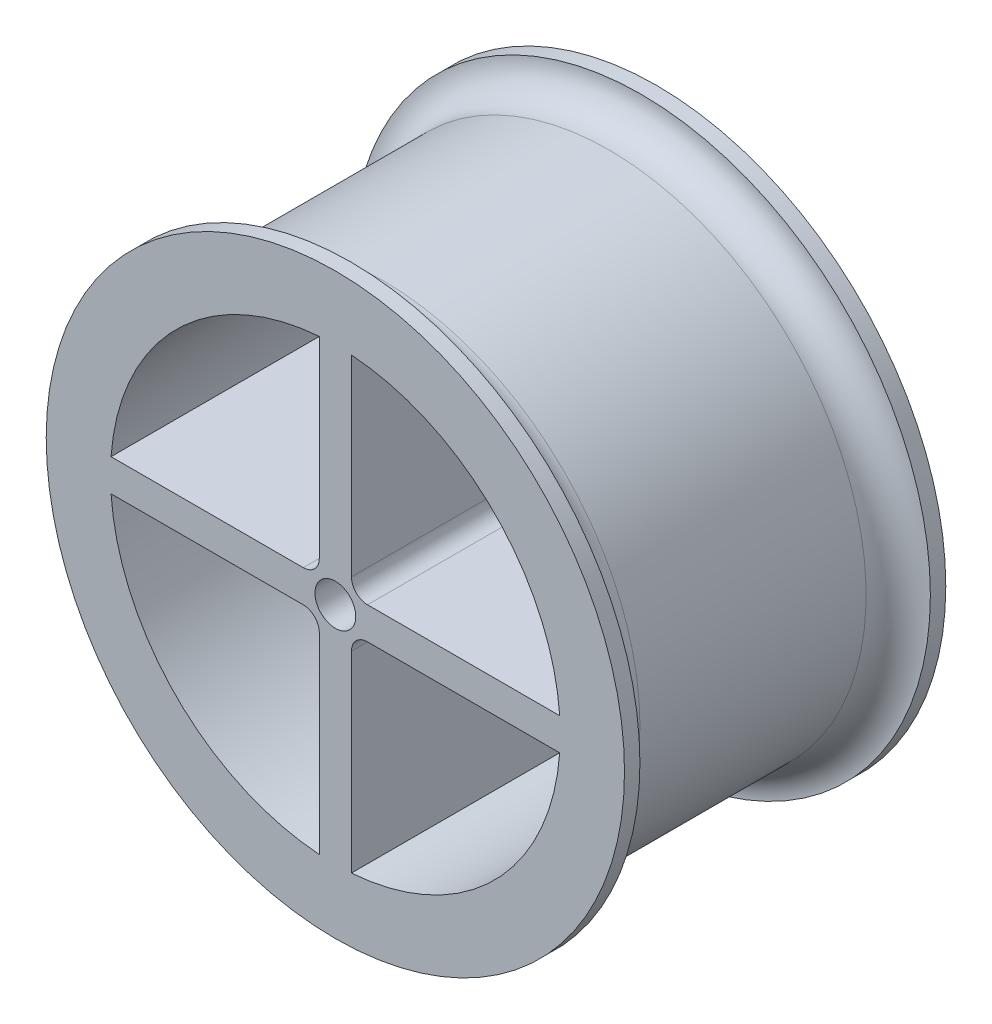
ISO-10303-21;
HEADER;
FILE_DESCRIPTION(('STEP AP214'),'2;1');
FILE_NAME('part.step','',(''),(''),'','','');
FILE_SCHEMA(('AUTOMOTIVE_DESIGN { 1 0 10303 214 1 1 1 1 }'));
ENDSEC;
DATA;
#1=APPLICATION_CONTEXT('core data for automotive mechanical design processes');
#2=APPLICATION_PROTOCOL_DEFINITION('international standard','automotive_design',2000,#1);
#3=PRODUCT_CONTEXT('',#1,'mechanical');
#4=PRODUCT('Part','Part','',(#3));
#5=PRODUCT_RELATED_PRODUCT_CATEGORY('part','',(#4));
#6=PRODUCT_DEFINITION_FORMATION('','',#4);
#7=PRODUCT_DEFINITION_CONTEXT('part definition',#1,'design');
#8=PRODUCT_DEFINITION('design','',#6,#7);
#9=PRODUCT_DEFINITION_SHAPE('','',#8);
#10=(LENGTH_UNIT() NAMED_UNIT(*) SI_UNIT(.MILLI.,.METRE.));
#11=(NAMED_UNIT(*) PLANE_ANGLE_UNIT() SI_UNIT($,.RADIAN.));
#12=(NAMED_UNIT(*) SI_UNIT($,.STERADIAN.) SOLID_ANGLE_UNIT());
#13=UNCERTAINTY_MEASURE_WITH_UNIT(LENGTH_MEASURE(1.E-05),#10,'distance_accuracy_value','');
#14=(GEOMETRIC_REPRESENTATION_CONTEXT(3) GLOBAL_UNCERTAINTY_ASSIGNED_CONTEXT((#13)) GLOBAL_UNIT_ASSIGNED_CONTEXT((#10,
#11,#12)) REPRESENTATION_CONTEXT('',''));
#15=CARTESIAN_POINT('',(0.,0.,0.));
#16=DIRECTION('',(0.,0.,1.));
#17=DIRECTION('',(1.,0.,0.));
#18=AXIS2_PLACEMENT_3D('',#15,#16,#17);
#19=CARTESIAN_POINT('',(0.,0.,25.));
#20=DIRECTION('',(0.,0.,-1.));
#21=DIRECTION('',(-1.,0.,0.));
#22=AXIS2_PLACEMENT_3D('',#19,#20,#21);
#23=CYLINDRICAL_SURFACE('',#22,40.);
#24=CARTESIAN_POINT('',(0.,0.,-17.6));
#25=DIRECTION('',(0.,0.,-1.));
#26=DIRECTION('',(-1.,0.,0.));
#27=AXIS2_PLACEMENT_3D('',#24,#25,#26);
#28=CIRCLE('',#27,40.);
#29=CARTESIAN_POINT('',(-40.,0.,-17.6));
#30=VERTEX_POINT('',#29);
#31=EDGE_CURVE('E11',#30,#30,#28,.F.);
#32=ORIENTED_EDGE('',*,*,#31,.T.);
#33=EDGE_LOOP('',(#32));
#34=FACE_BOUND('',#33,.T.);
#35=CARTESIAN_POINT('',(0.,0.,17.6));
#36=DIRECTION('',(0.,0.,1.));
#37=DIRECTION('',(1.,0.,0.));
#38=AXIS2_PLACEMENT_3D('',#35,#36,#37);
#39=CIRCLE('',#38,40.);
#40=CARTESIAN_POINT('',(40.,0.,17.6));
#41=VERTEX_POINT('',#40);
#42=EDGE_CURVE('E42',#41,#41,#39,.F.);
#43=ORIENTED_EDGE('',*,*,#42,.T.);
#44=EDGE_LOOP('',(#43));
#45=FACE_BOUND('',#44,.T.);
#46=ADVANCED_FACE('F34',(#34,#45),#23,.T.);
#47=CARTESIAN_POINT('',(0.,-2.5,25.));
#48=DIRECTION('',(0.,1.,0.));
#49=DIRECTION('',(0.,0.,1.));
#50=AXIS2_PLACEMENT_3D('',#47,#48,#49);
#51=PLANE('',#50);
#52=DIRECTION('',(1.,0.,0.));
#53=VECTOR('',#52,1.);
#54=CARTESIAN_POINT('',(0.,-2.5,-25.));
#55=LINE('',#54,#53);
#56=CARTESIAN_POINT('',(-34.9106001094224,-2.5,-25.));
#57=VERTEX_POINT('',#56);
#58=CARTESIAN_POINT('',(-5.,-2.5,-25.));
#59=VERTEX_POINT('',#58);
#60=EDGE_CURVE('E229',#57,#59,#55,.T.);
#61=ORIENTED_EDGE('',*,*,#60,.T.);
#62=DIRECTION('',(0.,0.,-1.));
#63=VECTOR('',#62,1.);
#64=CARTESIAN_POINT('',(-5.,-2.5,25.));
#65=LINE('',#64,#63);
#66=CARTESIAN_POINT('',(-5.,-2.5,25.));
#67=VERTEX_POINT('',#66);
#68=EDGE_CURVE('E255',#59,#67,#65,.F.);
#69=ORIENTED_EDGE('',*,*,#68,.T.);
#70=DIRECTION('',(1.,0.,0.));
#71=VECTOR('',#70,1.);
#72=CARTESIAN_POINT('',(0.,-2.5,25.));
#73=LINE('',#72,#71);
#74=CARTESIAN_POINT('',(-34.9106001094224,-2.5,25.));
#75=VERTEX_POINT('',#74);
#76=EDGE_CURVE('E198',#75,#67,#73,.T.);
#77=ORIENTED_EDGE('',*,*,#76,.F.);
#78=DIRECTION('',(0.,0.,-1.));
#79=VECTOR('',#78,1.);
#80=CARTESIAN_POINT('',(-34.9106001094224,-2.5,25.));
#81=LINE('',#80,#79);
#82=EDGE_CURVE('E237',#75,#57,#81,.T.);
#83=ORIENTED_EDGE('',*,*,#82,.T.);
#84=EDGE_LOOP('',(#61,#69,#77,#83));
#85=FACE_BOUND('',#84,.T.);
#86=ADVANCED_FACE('F339',(#85),#51,.F.);
#87=CARTESIAN_POINT('',(-2.5,0.,25.));
#88=DIRECTION('',(1.,0.,0.));
#89=DIRECTION('',(0.,0.,-1.));
#90=AXIS2_PLACEMENT_3D('',#87,#88,#89);
#91=PLANE('',#90);
#92=DIRECTION('',(0.,-1.,0.));
#93=VECTOR('',#92,1.);
#94=CARTESIAN_POINT('',(-2.5,0.,25.));
#95=LINE('',#94,#93);
#96=CARTESIAN_POINT('',(-2.5,-5.,25.));
#97=VERTEX_POINT('',#96);
#98=CARTESIAN_POINT('',(-2.5,-34.9106001094224,25.));
#99=VERTEX_POINT('',#98);
#100=EDGE_CURVE('E201',#97,#99,#95,.T.);
#101=ORIENTED_EDGE('',*,*,#100,.F.);
#102=DIRECTION('',(0.,0.,-1.));
#103=VECTOR('',#102,1.);
#104=CARTESIAN_POINT('',(-2.5,-5.,-25.));
#105=LINE('',#104,#103);
#106=CARTESIAN_POINT('',(-2.5,-5.,-25.));
#107=VERTEX_POINT('',#106);
#108=EDGE_CURVE('E243',#97,#107,#105,.T.);
#109=ORIENTED_EDGE('',*,*,#108,.T.);
#110=DIRECTION('',(0.,-1.,0.));
#111=VECTOR('',#110,1.);
#112=CARTESIAN_POINT('',(-2.5,0.,-25.));
#113=LINE('',#112,#111);
#114=CARTESIAN_POINT('',(-2.5,-34.9106001094224,-25.));
#115=VERTEX_POINT('',#114);
#116=EDGE_CURVE('E232',#107,#115,#113,.T.);
#117=ORIENTED_EDGE('',*,*,#116,.T.);
#118=DIRECTION('',(0.,0.,-1.));
#119=VECTOR('',#118,1.);
#120=CARTESIAN_POINT('',(-2.5,-34.9106001094224,25.));
#121=LINE('',#120,#119);
#122=EDGE_CURVE('E239',#99,#115,#121,.T.);
#123=ORIENTED_EDGE('',*,*,#122,.F.);
#124=EDGE_LOOP('',(#101,#109,#117,#123));
#125=FACE_BOUND('',#124,.T.);
#126=ADVANCED_FACE('F345',(#125),#91,.F.);
#127=CARTESIAN_POINT('',(2.5,0.,25.));
#128=DIRECTION('',(1.,0.,0.));
#129=DIRECTION('',(0.,0.,-1.));
#130=AXIS2_PLACEMENT_3D('',#127,#128,#129);
#131=PLANE('',#130);
#132=DIRECTION('',(0.,-1.,0.));
#133=VECTOR('',#132,1.);
#134=CARTESIAN_POINT('',(2.5,0.,-25.));
#135=LINE('',#134,#133);
#136=CARTESIAN_POINT('',(2.5,-5.,-25.));
#137=VERTEX_POINT('',#136);
#138=CARTESIAN_POINT('',(2.5,-34.9106001094224,-25.));
#139=VERTEX_POINT('',#138);
#140=EDGE_CURVE('E222',#137,#139,#135,.T.);
#141=ORIENTED_EDGE('',*,*,#140,.F.);
#142=DIRECTION('',(0.,0.,-1.));
#143=VECTOR('',#142,1.);
#144=CARTESIAN_POINT('',(2.5,-5.,25.));
#145=LINE('',#144,#143);
#146=CARTESIAN_POINT('',(2.5,-5.,25.));
#147=VERTEX_POINT('',#146);
#148=EDGE_CURVE('E260',#137,#147,#145,.F.);
#149=ORIENTED_EDGE('',*,*,#148,.T.);
#150=DIRECTION('',(0.,-1.,0.));
#151=VECTOR('',#150,1.);
#152=CARTESIAN_POINT('',(2.5,0.,25.));
#153=LINE('',#152,#151);
#154=CARTESIAN_POINT('',(2.5,-34.9106001094224,25.));
#155=VERTEX_POINT('',#154);
#156=EDGE_CURVE('E191',#147,#155,#153,.T.);
#157=ORIENTED_EDGE('',*,*,#156,.T.);
#158=DIRECTION('',(0.,0.,-1.));
#159=VECTOR('',#158,1.);
#160=CARTESIAN_POINT('',(2.5,-34.9106001094224,25.));
#161=LINE('',#160,#159);
#162=EDGE_CURVE('E244',#155,#139,#161,.T.);
#163=ORIENTED_EDGE('',*,*,#162,.T.);
#164=EDGE_LOOP('',(#141,#149,#157,#163));
#165=FACE_BOUND('',#164,.T.);
#166=ADVANCED_FACE('F356',(#165),#131,.T.);
#167=CARTESIAN_POINT('',(0.,-2.5,25.));
#168=DIRECTION('',(0.,1.,0.));
#169=DIRECTION('',(0.,0.,1.));
#170=AXIS2_PLACEMENT_3D('',#167,#168,#169);
#171=PLANE('',#170);
#172=DIRECTION('',(1.,0.,0.));
#173=VECTOR('',#172,1.);
#174=CARTESIAN_POINT('',(0.,-2.5,25.));
#175=LINE('',#174,#173);
#176=CARTESIAN_POINT('',(5.,-2.5,25.));
#177=VERTEX_POINT('',#176);
#178=CARTESIAN_POINT('',(34.9106001094224,-2.5,25.));
#179=VERTEX_POINT('',#178);
#180=EDGE_CURVE('E193',#177,#179,#175,.T.);
#181=ORIENTED_EDGE('',*,*,#180,.F.);
#182=DIRECTION('',(0.,0.,-1.));
#183=VECTOR('',#182,1.);
#184=CARTESIAN_POINT('',(5.,-2.5,25.));
#185=LINE('',#184,#183);
#186=CARTESIAN_POINT('',(5.,-2.5,-25.));
#187=VERTEX_POINT('',#186);
#188=EDGE_CURVE('E257',#177,#187,#185,.T.);
#189=ORIENTED_EDGE('',*,*,#188,.T.);
#190=DIRECTION('',(1.,0.,0.));
#191=VECTOR('',#190,1.);
#192=CARTESIAN_POINT('',(0.,-2.5,-25.));
#193=LINE('',#192,#191);
#194=CARTESIAN_POINT('',(34.9106001094224,-2.5,-25.));
#195=VERTEX_POINT('',#194);
#196=EDGE_CURVE('E224',#187,#195,#193,.T.);
#197=ORIENTED_EDGE('',*,*,#196,.T.);
#198=DIRECTION('',(0.,0.,-1.));
#199=VECTOR('',#198,1.);
#200=CARTESIAN_POINT('',(34.9106001094224,-2.5,25.));
#201=LINE('',#200,#199);
#202=EDGE_CURVE('E240',#179,#195,#201,.T.);
#203=ORIENTED_EDGE('',*,*,#202,.F.);
#204=EDGE_LOOP('',(#181,#189,#197,#203));
#205=FACE_BOUND('',#204,.T.);
#206=ADVANCED_FACE('F363',(#205),#171,.F.);
#207=CARTESIAN_POINT('',(0.,0.,25.));
#208=DIRECTION('',(0.,0.,-1.));
#209=DIRECTION('',(-1.,0.,0.));
#210=AXIS2_PLACEMENT_3D('',#207,#208,#209);
#211=CYLINDRICAL_SURFACE('',#210,35.);
#212=CARTESIAN_POINT('',(0.,0.,-25.));
#213=DIRECTION('',(0.,0.,1.));
#214=DIRECTION('',(1.,0.,0.));
#215=AXIS2_PLACEMENT_3D('',#212,#213,#214);
#216=CIRCLE('',#215,35.);
#217=CARTESIAN_POINT('',(-2.5,34.9106001094224,-25.));
#218=VERTEX_POINT('',#217);
#219=CARTESIAN_POINT('',(-34.9106001094224,2.5,-25.));
#220=VERTEX_POINT('',#219);
#221=EDGE_CURVE('E215',#218,#220,#216,.T.);
#222=ORIENTED_EDGE('',*,*,#221,.F.);
#223=DIRECTION('',(0.,0.,-1.));
#224=VECTOR('',#223,1.);
#225=CARTESIAN_POINT('',(-2.5,34.9106001094224,25.));
#226=LINE('',#225,#224);
#227=CARTESIAN_POINT('',(-2.5,34.9106001094224,25.));
#228=VERTEX_POINT('',#227);
#229=EDGE_CURVE('E247',#228,#218,#226,.T.);
#230=ORIENTED_EDGE('',*,*,#229,.F.);
#231=CARTESIAN_POINT('',(0.,0.,25.));
#232=DIRECTION('',(0.,0.,1.));
#233=DIRECTION('',(1.,0.,0.));
#234=AXIS2_PLACEMENT_3D('',#231,#232,#233);
#235=CIRCLE('',#234,35.);
#236=CARTESIAN_POINT('',(-34.9106001094224,2.5,25.));
#237=VERTEX_POINT('',#236);
#238=EDGE_CURVE('E180',#228,#237,#235,.T.);
#239=ORIENTED_EDGE('',*,*,#238,.T.);
#240=DIRECTION('',(0.,0.,-1.));
#241=VECTOR('',#240,1.);
#242=CARTESIAN_POINT('',(-34.9106001094224,2.5,25.));
#243=LINE('',#242,#241);
#244=EDGE_CURVE('E161',#237,#220,#243,.T.);
#245=ORIENTED_EDGE('',*,*,#244,.T.);
#246=EDGE_LOOP('',(#222,#230,#239,#245));
#247=FACE_BOUND('',#246,.T.);
#248=ADVANCED_FACE('F366',(#247),#211,.F.);
#249=CARTESIAN_POINT('',(-2.5,0.,25.));
#250=DIRECTION('',(1.,0.,0.));
#251=DIRECTION('',(0.,0.,-1.));
#252=AXIS2_PLACEMENT_3D('',#249,#250,#251);
#253=PLANE('',#252);
#254=DIRECTION('',(0.,-1.,0.));
#255=VECTOR('',#254,1.);
#256=CARTESIAN_POINT('',(-2.5,0.,-25.));
#257=LINE('',#256,#255);
#258=CARTESIAN_POINT('',(-2.5,5.,-25.));
#259=VERTEX_POINT('',#258);
#260=EDGE_CURVE('E218',#218,#259,#257,.T.);
#261=ORIENTED_EDGE('',*,*,#260,.T.);
#262=DIRECTION('',(0.,0.,-1.));
#263=VECTOR('',#262,1.);
#264=CARTESIAN_POINT('',(-2.5,5.,25.));
#265=LINE('',#264,#263);
#266=CARTESIAN_POINT('',(-2.5,5.,25.));
#267=VERTEX_POINT('',#266);
#268=EDGE_CURVE('E49',#259,#267,#265,.F.);
#269=ORIENTED_EDGE('',*,*,#268,.T.);
#270=DIRECTION('',(0.,-1.,0.));
#271=VECTOR('',#270,1.);
#272=CARTESIAN_POINT('',(-2.5,0.,25.));
#273=LINE('',#272,#271);
#274=EDGE_CURVE('E186',#228,#267,#273,.T.);
#275=ORIENTED_EDGE('',*,*,#274,.F.);
#276=ORIENTED_EDGE('',*,*,#229,.T.);
#277=EDGE_LOOP('',(#261,#269,#275,#276));
#278=FACE_BOUND('',#277,.T.);
#279=ADVANCED_FACE('F375',(#278),#253,.F.);
#280=CARTESIAN_POINT('',(0.,2.5,25.));
#281=DIRECTION('',(0.,1.,0.));
#282=DIRECTION('',(0.,0.,1.));
#283=AXIS2_PLACEMENT_3D('',#280,#281,#282);
#284=PLANE('',#283);
#285=DIRECTION('',(1.,0.,0.));
#286=VECTOR('',#285,1.);
#287=CARTESIAN_POINT('',(0.,2.5,-25.));
#288=LINE('',#287,#286);
#289=CARTESIAN_POINT('',(5.,2.5,-25.));
#290=VERTEX_POINT('',#289);
#291=CARTESIAN_POINT('',(34.9106001094224,2.5,-25.));
#292=VERTEX_POINT('',#291);
#293=EDGE_CURVE('E206',#290,#292,#288,.T.);
#294=ORIENTED_EDGE('',*,*,#293,.F.);
#295=DIRECTION('',(0.,0.,-1.));
#296=VECTOR('',#295,1.);
#297=CARTESIAN_POINT('',(5.,2.5,25.));
#298=LINE('',#297,#296);
#299=CARTESIAN_POINT('',(5.,2.5,25.));
#300=VERTEX_POINT('',#299);
#301=EDGE_CURVE('E264',#290,#300,#298,.F.);
#302=ORIENTED_EDGE('',*,*,#301,.T.);
#303=DIRECTION('',(1.,0.,0.));
#304=VECTOR('',#303,1.);
#305=CARTESIAN_POINT('',(0.,2.5,25.));
#306=LINE('',#305,#304);
#307=CARTESIAN_POINT('',(34.9106001094224,2.5,25.));
#308=VERTEX_POINT('',#307);
#309=EDGE_CURVE('E172',#300,#308,#306,.T.);
#310=ORIENTED_EDGE('',*,*,#309,.T.);
#311=DIRECTION('',(0.,0.,-1.));
#312=VECTOR('',#311,1.);
#313=CARTESIAN_POINT('',(34.9106001094224,2.5,25.));
#314=LINE('',#313,#312);
#315=EDGE_CURVE('E162',#308,#292,#314,.T.);
#316=ORIENTED_EDGE('',*,*,#315,.T.);
#317=EDGE_LOOP('',(#294,#302,#310,#316));
#318=FACE_BOUND('',#317,.T.);
#319=ADVANCED_FACE('F305',(#318),#284,.T.);
#320=CARTESIAN_POINT('',(2.5,0.,25.));
#321=DIRECTION('',(1.,0.,0.));
#322=DIRECTION('',(0.,0.,-1.));
#323=AXIS2_PLACEMENT_3D('',#320,#321,#322);
#324=PLANE('',#323);
#325=DIRECTION('',(0.,-1.,0.));
#326=VECTOR('',#325,1.);
#327=CARTESIAN_POINT('',(2.5,0.,25.));
#328=LINE('',#327,#326);
#329=CARTESIAN_POINT('',(2.5,34.9106001094224,25.));
#330=VERTEX_POINT('',#329);
#331=CARTESIAN_POINT('',(2.5,5.,25.));
#332=VERTEX_POINT('',#331);
#333=EDGE_CURVE('E153',#330,#332,#328,.T.);
#334=ORIENTED_EDGE('',*,*,#333,.T.);
#335=DIRECTION('',(0.,0.,-1.));
#336=VECTOR('',#335,1.);
#337=CARTESIAN_POINT('',(2.5,5.,-25.));
#338=LINE('',#337,#336);
#339=CARTESIAN_POINT('',(2.5,5.,-25.));
#340=VERTEX_POINT('',#339);
#341=EDGE_CURVE('E262',#332,#340,#338,.T.);
#342=ORIENTED_EDGE('',*,*,#341,.T.);
#343=DIRECTION('',(0.,-1.,0.));
#344=VECTOR('',#343,1.);
#345=CARTESIAN_POINT('',(2.5,0.,-25.));
#346=LINE('',#345,#344);
#347=CARTESIAN_POINT('',(2.5,34.9106001094224,-25.));
#348=VERTEX_POINT('',#347);
#349=EDGE_CURVE('E156',#348,#340,#346,.T.);
#350=ORIENTED_EDGE('',*,*,#349,.F.);
#351=DIRECTION('',(0.,0.,-1.));
#352=VECTOR('',#351,1.);
#353=CARTESIAN_POINT('',(2.5,34.9106001094224,25.));
#354=LINE('',#353,#352);
#355=EDGE_CURVE('E149',#330,#348,#354,.T.);
#356=ORIENTED_EDGE('',*,*,#355,.F.);
#357=EDGE_LOOP('',(#334,#342,#350,#356));
#358=FACE_BOUND('',#357,.T.);
#359=ADVANCED_FACE('F151',(#358),#324,.T.);
#360=CARTESIAN_POINT('',(0.,0.,25.));
#361=DIRECTION('',(0.,0.,-1.));
#362=DIRECTION('',(-1.,0.,0.));
#363=AXIS2_PLACEMENT_3D('',#360,#361,#362);
#364=CYLINDRICAL_SURFACE('',#363,35.);
#365=CARTESIAN_POINT('',(0.,0.,-25.));
#366=DIRECTION('',(0.,0.,1.));
#367=DIRECTION('',(1.,0.,0.));
#368=AXIS2_PLACEMENT_3D('',#365,#366,#367);
#369=CIRCLE('',#368,35.);
#370=EDGE_CURVE('E234',#57,#115,#369,.T.);
#371=ORIENTED_EDGE('',*,*,#370,.F.);
#372=ORIENTED_EDGE('',*,*,#82,.F.);
#373=CARTESIAN_POINT('',(0.,0.,25.));
#374=DIRECTION('',(0.,0.,1.));
#375=DIRECTION('',(1.,0.,0.));
#376=AXIS2_PLACEMENT_3D('',#373,#374,#375);
#377=CIRCLE('',#376,35.);
#378=EDGE_CURVE('E203',#75,#99,#377,.T.);
#379=ORIENTED_EDGE('',*,*,#378,.T.);
#380=ORIENTED_EDGE('',*,*,#122,.T.);
#381=EDGE_LOOP('',(#371,#372,#379,#380));
#382=FACE_BOUND('',#381,.T.);
#383=ADVANCED_FACE('F350',(#382),#364,.F.);
#384=CARTESIAN_POINT('',(0.,0.,25.));
#385=DIRECTION('',(0.,0.,-1.));
#386=DIRECTION('',(-1.,0.,0.));
#387=AXIS2_PLACEMENT_3D('',#384,#385,#386);
#388=CYLINDRICAL_SURFACE('',#387,35.);
#389=CARTESIAN_POINT('',(0.,0.,-25.));
#390=DIRECTION('',(0.,0.,1.));
#391=DIRECTION('',(1.,0.,0.));
#392=AXIS2_PLACEMENT_3D('',#389,#390,#391);
#393=CIRCLE('',#392,35.);
#394=EDGE_CURVE('E226',#139,#195,#393,.T.);
#395=ORIENTED_EDGE('',*,*,#394,.F.);
#396=ORIENTED_EDGE('',*,*,#162,.F.);
#397=CARTESIAN_POINT('',(0.,0.,25.));
#398=DIRECTION('',(0.,0.,1.));
#399=DIRECTION('',(1.,0.,0.));
#400=AXIS2_PLACEMENT_3D('',#397,#398,#399);
#401=CIRCLE('',#400,35.);
#402=EDGE_CURVE('E195',#155,#179,#401,.T.);
#403=ORIENTED_EDGE('',*,*,#402,.T.);
#404=ORIENTED_EDGE('',*,*,#202,.T.);
#405=EDGE_LOOP('',(#395,#396,#403,#404));
#406=FACE_BOUND('',#405,.T.);
#407=ADVANCED_FACE('F353',(#406),#388,.F.);
#408=CARTESIAN_POINT('',(0.,2.5,25.));
#409=DIRECTION('',(0.,1.,0.));
#410=DIRECTION('',(0.,0.,1.));
#411=AXIS2_PLACEMENT_3D('',#408,#409,#410);
#412=PLANE('',#411);
#413=DIRECTION('',(1.,0.,0.));
#414=VECTOR('',#413,1.);
#415=CARTESIAN_POINT('',(0.,2.5,25.));
#416=LINE('',#415,#414);
#417=CARTESIAN_POINT('',(-5.,2.5,25.));
#418=VERTEX_POINT('',#417);
#419=EDGE_CURVE('E188',#237,#418,#416,.T.);
#420=ORIENTED_EDGE('',*,*,#419,.T.);
#421=DIRECTION('',(0.,0.,-1.));
#422=VECTOR('',#421,1.);
#423=CARTESIAN_POINT('',(-5.,2.5,25.));
#424=LINE('',#423,#422);
#425=CARTESIAN_POINT('',(-5.,2.5,-25.));
#426=VERTEX_POINT('',#425);
#427=EDGE_CURVE('E266',#418,#426,#424,.T.);
#428=ORIENTED_EDGE('',*,*,#427,.T.);
#429=DIRECTION('',(1.,0.,0.));
#430=VECTOR('',#429,1.);
#431=CARTESIAN_POINT('',(0.,2.5,-25.));
#432=LINE('',#431,#430);
#433=EDGE_CURVE('E220',#220,#426,#432,.T.);
#434=ORIENTED_EDGE('',*,*,#433,.F.);
#435=ORIENTED_EDGE('',*,*,#244,.F.);
#436=EDGE_LOOP('',(#420,#428,#434,#435));
#437=FACE_BOUND('',#436,.T.);
#438=ADVANCED_FACE('F361',(#437),#412,.T.);
#439=CARTESIAN_POINT('',(0.,0.,25.));
#440=DIRECTION('',(0.,0.,-1.));
#441=DIRECTION('',(-1.,0.,0.));
#442=AXIS2_PLACEMENT_3D('',#439,#440,#441);
#443=CYLINDRICAL_SURFACE('',#442,3.175);
#444=CARTESIAN_POINT('',(0.,0.,25.));
#445=DIRECTION('',(0.,0.,1.));
#446=DIRECTION('',(1.,0.,0.));
#447=AXIS2_PLACEMENT_3D('',#444,#445,#446);
#448=CIRCLE('',#447,3.175);
#449=CARTESIAN_POINT('',(3.175,0.,25.));
#450=VERTEX_POINT('',#449);
#451=EDGE_CURVE('E177',#450,#450,#448,.T.);
#452=ORIENTED_EDGE('',*,*,#451,.T.);
#453=EDGE_LOOP('',(#452));
#454=FACE_BOUND('',#453,.T.);
#455=CARTESIAN_POINT('',(0.,0.,-25.));
#456=DIRECTION('',(0.,0.,1.));
#457=DIRECTION('',(1.,0.,0.));
#458=AXIS2_PLACEMENT_3D('',#455,#456,#457);
#459=CIRCLE('',#458,3.175);
#460=CARTESIAN_POINT('',(3.175,0.,-25.));
#461=VERTEX_POINT('',#460);
#462=EDGE_CURVE('E212',#461,#461,#459,.T.);
#463=ORIENTED_EDGE('',*,*,#462,.F.);
#464=EDGE_LOOP('',(#463));
#465=FACE_BOUND('',#464,.T.);
#466=ADVANCED_FACE('F373',(#454,#465),#443,.F.);
#467=CARTESIAN_POINT('',(0.,0.,25.));
#468=DIRECTION('',(0.,0.,-1.));
#469=DIRECTION('',(-1.,0.,0.));
#470=AXIS2_PLACEMENT_3D('',#467,#468,#469);
#471=CYLINDRICAL_SURFACE('',#470,35.);
#472=CARTESIAN_POINT('',(0.,0.,-25.));
#473=DIRECTION('',(0.,0.,1.));
#474=DIRECTION('',(1.,0.,0.));
#475=AXIS2_PLACEMENT_3D('',#472,#473,#474);
#476=CIRCLE('',#475,35.);
#477=EDGE_CURVE('E210',#292,#348,#476,.T.);
#478=ORIENTED_EDGE('',*,*,#477,.F.);
#479=ORIENTED_EDGE('',*,*,#315,.F.);
#480=CARTESIAN_POINT('',(0.,0.,25.));
#481=DIRECTION('',(0.,0.,1.));
#482=DIRECTION('',(1.,0.,0.));
#483=AXIS2_PLACEMENT_3D('',#480,#481,#482);
#484=CIRCLE('',#483,35.);
#485=EDGE_CURVE('E169',#308,#330,#484,.T.);
#486=ORIENTED_EDGE('',*,*,#485,.T.);
#487=ORIENTED_EDGE('',*,*,#355,.T.);
#488=EDGE_LOOP('',(#478,#479,#486,#487));
#489=FACE_BOUND('',#488,.T.);
#490=ADVANCED_FACE('F175',(#489),#471,.F.);
#491=CARTESIAN_POINT('',(0.,0.,25.));
#492=DIRECTION('',(0.,0.,1.));
#493=DIRECTION('',(1.,0.,0.));
#494=AXIS2_PLACEMENT_3D('',#491,#492,#493);
#495=PLANE('',#494);
#496=ORIENTED_EDGE('',*,*,#309,.F.);
#497=CARTESIAN_POINT('',(5.,5.,25.));
#498=DIRECTION('',(0.,0.,1.));
#499=DIRECTION('',(1.,0.,0.));
#500=AXIS2_PLACEMENT_3D('',#497,#498,#499);
#501=CIRCLE('',#500,2.5);
#502=EDGE_CURVE('E171',#300,#332,#501,.F.);
#503=ORIENTED_EDGE('',*,*,#502,.T.);
#504=ORIENTED_EDGE('',*,*,#333,.F.);
#505=ORIENTED_EDGE('',*,*,#485,.F.);
#506=EDGE_LOOP('',(#496,#503,#504,#505));
#507=FACE_BOUND('',#506,.T.);
#508=ORIENTED_EDGE('',*,*,#451,.F.);
#509=EDGE_LOOP('',(#508));
#510=FACE_BOUND('',#509,.T.);
#511=ORIENTED_EDGE('',*,*,#238,.F.);
#512=ORIENTED_EDGE('',*,*,#274,.T.);
#513=CARTESIAN_POINT('',(-5.,5.,25.));
#514=DIRECTION('',(0.,0.,1.));
#515=DIRECTION('',(1.,0.,0.));
#516=AXIS2_PLACEMENT_3D('',#513,#514,#515);
#517=CIRCLE('',#516,2.5);
#518=EDGE_CURVE('E282',#267,#418,#517,.F.);
#519=ORIENTED_EDGE('',*,*,#518,.T.);
#520=ORIENTED_EDGE('',*,*,#419,.F.);
#521=EDGE_LOOP('',(#511,#512,#519,#520));
#522=FACE_BOUND('',#521,.T.);
#523=ORIENTED_EDGE('',*,*,#156,.F.);
#524=CARTESIAN_POINT('',(5.,-5.,25.));
#525=DIRECTION('',(0.,0.,1.));
#526=DIRECTION('',(1.,0.,0.));
#527=AXIS2_PLACEMENT_3D('',#524,#525,#526);
#528=CIRCLE('',#527,2.5);
#529=EDGE_CURVE('E276',#147,#177,#528,.F.);
#530=ORIENTED_EDGE('',*,*,#529,.T.);
#531=ORIENTED_EDGE('',*,*,#180,.T.);
#532=ORIENTED_EDGE('',*,*,#402,.F.);
#533=EDGE_LOOP('',(#523,#530,#531,#532));
#534=FACE_BOUND('',#533,.T.);
#535=ORIENTED_EDGE('',*,*,#76,.T.);
#536=CARTESIAN_POINT('',(-5.,-5.,25.));
#537=DIRECTION('',(0.,0.,1.));
#538=DIRECTION('',(1.,0.,0.));
#539=AXIS2_PLACEMENT_3D('',#536,#537,#538);
#540=CIRCLE('',#539,2.5);
#541=EDGE_CURVE('E272',#67,#97,#540,.F.);
#542=ORIENTED_EDGE('',*,*,#541,.T.);
#543=ORIENTED_EDGE('',*,*,#100,.T.);
#544=ORIENTED_EDGE('',*,*,#378,.F.);
#545=EDGE_LOOP('',(#535,#542,#543,#544));
#546=FACE_BOUND('',#545,.T.);
#547=CARTESIAN_POINT('',(0.,0.,25.));
#548=DIRECTION('',(0.,0.,1.));
#549=DIRECTION('',(1.,0.,0.));
#550=AXIS2_PLACEMENT_3D('',#547,#548,#549);
#551=CIRCLE('',#550,45.);
#552=CARTESIAN_POINT('',(45.,0.,25.));
#553=VERTEX_POINT('',#552);
#554=EDGE_CURVE('E295',#553,#553,#551,.T.);
#555=ORIENTED_EDGE('',*,*,#554,.T.);
#556=EDGE_LOOP('',(#555));
#557=FACE_BOUND('',#556,.T.);
#558=ADVANCED_FACE('F167',(#507,#510,#522,#534,#546,#557),#495,.T.);
#559=CARTESIAN_POINT('',(0.,0.,-25.));
#560=DIRECTION('',(0.,0.,1.));
#561=DIRECTION('',(1.,0.,0.));
#562=AXIS2_PLACEMENT_3D('',#559,#560,#561);
#563=PLANE('',#562);
#564=ORIENTED_EDGE('',*,*,#349,.T.);
#565=CARTESIAN_POINT('',(5.,5.,-25.));
#566=DIRECTION('',(0.,0.,1.));
#567=DIRECTION('',(1.,0.,0.));
#568=AXIS2_PLACEMENT_3D('',#565,#566,#567);
#569=CIRCLE('',#568,2.5);
#570=EDGE_CURVE('E278',#340,#290,#569,.T.);
#571=ORIENTED_EDGE('',*,*,#570,.T.);
#572=ORIENTED_EDGE('',*,*,#293,.T.);
#573=ORIENTED_EDGE('',*,*,#477,.T.);
#574=EDGE_LOOP('',(#564,#571,#572,#573));
#575=FACE_BOUND('',#574,.T.);
#576=ORIENTED_EDGE('',*,*,#462,.T.);
#577=EDGE_LOOP('',(#576));
#578=FACE_BOUND('',#577,.T.);
#579=ORIENTED_EDGE('',*,*,#221,.T.);
#580=ORIENTED_EDGE('',*,*,#433,.T.);
#581=CARTESIAN_POINT('',(-5.,5.,-25.));
#582=DIRECTION('',(0.,0.,1.));
#583=DIRECTION('',(1.,0.,0.));
#584=AXIS2_PLACEMENT_3D('',#581,#582,#583);
#585=CIRCLE('',#584,2.5);
#586=EDGE_CURVE('E57',#426,#259,#585,.T.);
#587=ORIENTED_EDGE('',*,*,#586,.T.);
#588=ORIENTED_EDGE('',*,*,#260,.F.);
#589=EDGE_LOOP('',(#579,#580,#587,#588));
#590=FACE_BOUND('',#589,.T.);
#591=ORIENTED_EDGE('',*,*,#196,.F.);
#592=CARTESIAN_POINT('',(5.,-5.,-25.));
#593=DIRECTION('',(0.,0.,1.));
#594=DIRECTION('',(1.,0.,0.));
#595=AXIS2_PLACEMENT_3D('',#592,#593,#594);
#596=CIRCLE('',#595,2.5);
#597=EDGE_CURVE('E274',#187,#137,#596,.T.);
#598=ORIENTED_EDGE('',*,*,#597,.T.);
#599=ORIENTED_EDGE('',*,*,#140,.T.);
#600=ORIENTED_EDGE('',*,*,#394,.T.);
#601=EDGE_LOOP('',(#591,#598,#599,#600));
#602=FACE_BOUND('',#601,.T.);
#603=ORIENTED_EDGE('',*,*,#60,.F.);
#604=ORIENTED_EDGE('',*,*,#370,.T.);
#605=ORIENTED_EDGE('',*,*,#116,.F.);
#606=CARTESIAN_POINT('',(-5.,-5.,-25.));
#607=DIRECTION('',(0.,0.,1.));
#608=DIRECTION('',(1.,0.,0.));
#609=AXIS2_PLACEMENT_3D('',#606,#607,#608);
#610=CIRCLE('',#609,2.5);
#611=EDGE_CURVE('E270',#107,#59,#610,.T.);
#612=ORIENTED_EDGE('',*,*,#611,.T.);
#613=EDGE_LOOP('',(#603,#604,#605,#612));
#614=FACE_BOUND('',#613,.T.);
#615=CARTESIAN_POINT('',(0.,0.,-25.));
#616=DIRECTION('',(0.,0.,1.));
#617=DIRECTION('',(1.,0.,0.));
#618=AXIS2_PLACEMENT_3D('',#615,#616,#617);
#619=CIRCLE('',#618,45.);
#620=CARTESIAN_POINT('',(45.,0.,-25.));
#621=VERTEX_POINT('',#620);
#622=EDGE_CURVE('E301',#621,#621,#619,.T.);
#623=ORIENTED_EDGE('',*,*,#622,.F.);
#624=EDGE_LOOP('',(#623));
#625=FACE_BOUND('',#624,.T.);
#626=ADVANCED_FACE('F310',(#575,#578,#590,#602,#614,#625),#563,.F.);
#627=CARTESIAN_POINT('',(0.,0.,22.6));
#628=DIRECTION('',(0.,0.,1.));
#629=DIRECTION('',(1.,0.,0.));
#630=AXIS2_PLACEMENT_3D('',#627,#628,#629);
#631=CYLINDRICAL_SURFACE('',#630,45.);
#632=CARTESIAN_POINT('',(0.,0.,22.6));
#633=DIRECTION('',(0.,0.,1.));
#634=DIRECTION('',(1.,0.,0.));
#635=AXIS2_PLACEMENT_3D('',#632,#633,#634);
#636=CIRCLE('',#635,45.);
#637=CARTESIAN_POINT('',(45.,0.,22.6));
#638=VERTEX_POINT('',#637);
#639=EDGE_CURVE('E208',#638,#638,#636,.T.);
#640=ORIENTED_EDGE('',*,*,#639,.T.);
#641=EDGE_LOOP('',(#640));
#642=FACE_BOUND('',#641,.T.);
#643=ORIENTED_EDGE('',*,*,#554,.F.);
#644=EDGE_LOOP('',(#643));
#645=FACE_BOUND('',#644,.T.);
#646=ADVANCED_FACE('F313',(#642,#645),#631,.T.);
#647=CARTESIAN_POINT('',(-5.,-5.,25.));
#648=DIRECTION('',(0.,0.,1.));
#649=DIRECTION('',(1.,0.,0.));
#650=AXIS2_PLACEMENT_3D('',#647,#648,#649);
#651=CYLINDRICAL_SURFACE('',#650,2.5);
#652=ORIENTED_EDGE('',*,*,#541,.F.);
#653=ORIENTED_EDGE('',*,*,#68,.F.);
#654=ORIENTED_EDGE('',*,*,#611,.F.);
#655=ORIENTED_EDGE('',*,*,#108,.F.);
#656=EDGE_LOOP('',(#652,#653,#654,#655));
#657=FACE_BOUND('',#656,.T.);
#658=ADVANCED_FACE('F390',(#657),#651,.F.);
#659=CARTESIAN_POINT('',(5.,-5.,25.));
#660=DIRECTION('',(0.,0.,-1.));
#661=DIRECTION('',(-1.,0.,0.));
#662=AXIS2_PLACEMENT_3D('',#659,#660,#661);
#663=CYLINDRICAL_SURFACE('',#662,2.5);
#664=ORIENTED_EDGE('',*,*,#529,.F.);
#665=ORIENTED_EDGE('',*,*,#148,.F.);
#666=ORIENTED_EDGE('',*,*,#597,.F.);
#667=ORIENTED_EDGE('',*,*,#188,.F.);
#668=EDGE_LOOP('',(#664,#665,#666,#667));
#669=FACE_BOUND('',#668,.T.);
#670=ADVANCED_FACE('F393',(#669),#663,.F.);
#671=CARTESIAN_POINT('',(5.,5.,25.));
#672=DIRECTION('',(0.,0.,1.));
#673=DIRECTION('',(1.,0.,0.));
#674=AXIS2_PLACEMENT_3D('',#671,#672,#673);
#675=CYLINDRICAL_SURFACE('',#674,2.5);
#676=ORIENTED_EDGE('',*,*,#502,.F.);
#677=ORIENTED_EDGE('',*,*,#301,.F.);
#678=ORIENTED_EDGE('',*,*,#570,.F.);
#679=ORIENTED_EDGE('',*,*,#341,.F.);
#680=EDGE_LOOP('',(#676,#677,#678,#679));
#681=FACE_BOUND('',#680,.T.);
#682=ADVANCED_FACE('F308',(#681),#675,.F.);
#683=CARTESIAN_POINT('',(-5.,5.,25.));
#684=DIRECTION('',(0.,0.,-1.));
#685=DIRECTION('',(-1.,0.,0.));
#686=AXIS2_PLACEMENT_3D('',#683,#684,#685);
#687=CYLINDRICAL_SURFACE('',#686,2.5);
#688=ORIENTED_EDGE('',*,*,#518,.F.);
#689=ORIENTED_EDGE('',*,*,#268,.F.);
#690=ORIENTED_EDGE('',*,*,#586,.F.);
#691=ORIENTED_EDGE('',*,*,#427,.F.);
#692=EDGE_LOOP('',(#688,#689,#690,#691));
#693=FACE_BOUND('',#692,.T.);
#694=ADVANCED_FACE('F291',(#693),#687,.F.);
#695=CARTESIAN_POINT('',(0.,0.,17.6));
#696=DIRECTION('',(0.,0.,1.));
#697=DIRECTION('',(1.,0.,0.));
#698=AXIS2_PLACEMENT_3D('',#695,#696,#697);
#699=TOROIDAL_SURFACE('',#698,45.,5.);
#700=ORIENTED_EDGE('',*,*,#42,.F.);
#701=EDGE_LOOP('',(#700));
#702=FACE_BOUND('',#701,.T.);
#703=ORIENTED_EDGE('',*,*,#639,.F.);
#704=EDGE_LOOP('',(#703));
#705=FACE_BOUND('',#704,.T.);
#706=ADVANCED_FACE('F287',(#702,#705),#699,.F.);
#707=CARTESIAN_POINT('',(0.,0.,-22.6));
#708=DIRECTION('',(0.,0.,-1.));
#709=DIRECTION('',(-1.,0.,0.));
#710=AXIS2_PLACEMENT_3D('',#707,#708,#709);
#711=CYLINDRICAL_SURFACE('',#710,45.);
#712=CARTESIAN_POINT('',(0.,0.,-22.6));
#713=DIRECTION('',(0.,0.,1.));
#714=DIRECTION('',(1.,0.,0.));
#715=AXIS2_PLACEMENT_3D('',#712,#713,#714);
#716=CIRCLE('',#715,45.);
#717=CARTESIAN_POINT('',(45.,0.,-22.6));
#718=VERTEX_POINT('',#717);
#719=EDGE_CURVE('E298',#718,#718,#716,.T.);
#720=ORIENTED_EDGE('',*,*,#719,.F.);
#721=EDGE_LOOP('',(#720));
#722=FACE_BOUND('',#721,.T.);
#723=ORIENTED_EDGE('',*,*,#622,.T.);
#724=EDGE_LOOP('',(#723));
#725=FACE_BOUND('',#724,.T.);
#726=ADVANCED_FACE('F290',(#722,#725),#711,.T.);
#727=CARTESIAN_POINT('',(0.,0.,-17.6));
#728=DIRECTION('',(0.,0.,-1.));
#729=DIRECTION('',(-1.,0.,0.));
#730=AXIS2_PLACEMENT_3D('',#727,#728,#729);
#731=TOROIDAL_SURFACE('',#730,45.,5.);
#732=ORIENTED_EDGE('',*,*,#31,.F.);
#733=EDGE_LOOP('',(#732));
#734=FACE_BOUND('',#733,.T.);
#735=ORIENTED_EDGE('',*,*,#719,.T.);
#736=EDGE_LOOP('',(#735));
#737=FACE_BOUND('',#736,.T.);
#738=ADVANCED_FACE('F36',(#734,#737),#731,.F.);
#739=CLOSED_SHELL('',(#46,#86,#126,#166,#206,#248,#279,#319,#359,#383,#407,#438,#466,#490,#558,
#626,#646,#658,#670,#682,#694,#706,#726,#738));
#740=MANIFOLD_SOLID_BREP('B2',#739);
#741=ADVANCED_BREP_SHAPE_REPRESENTATION('',(#18,#740),#14);
#742=SHAPE_DEFINITION_REPRESENTATION(#9,#741);
ENDSEC;
END-ISO-10303-21;
